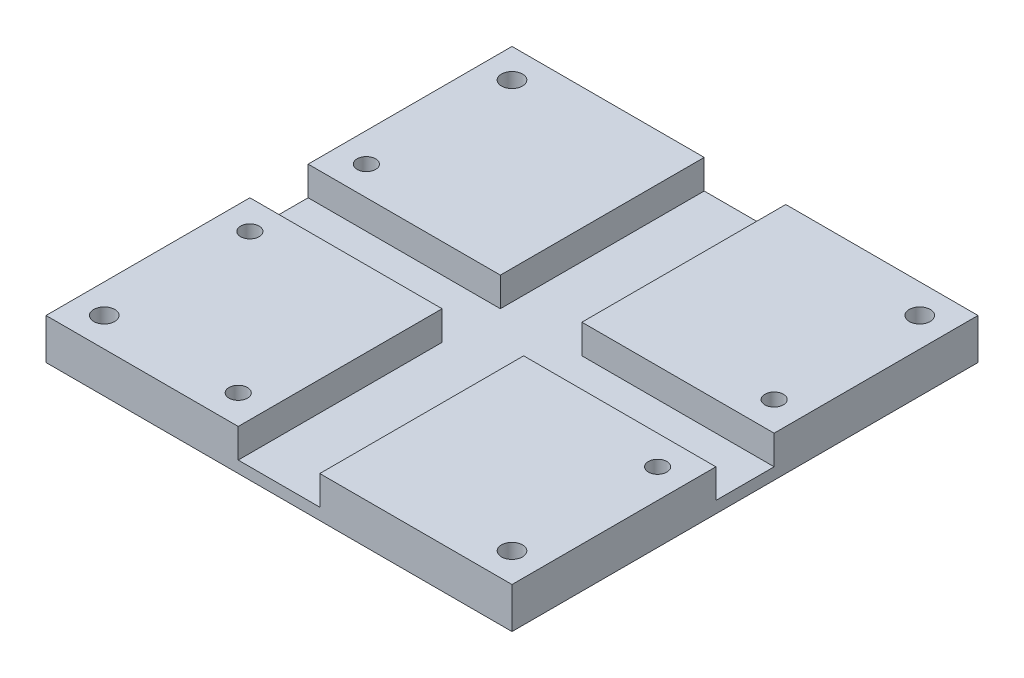
ISO-10303-21;
HEADER;
FILE_DESCRIPTION(('STEP AP214'),'2;1');
FILE_NAME('part.step','',(''),(''),'','','');
FILE_SCHEMA(('AUTOMOTIVE_DESIGN { 1 0 10303 214 1 1 1 1 }'));
ENDSEC;
DATA;
#1=APPLICATION_CONTEXT('core data for automotive mechanical design processes');
#2=APPLICATION_PROTOCOL_DEFINITION('international standard','automotive_design',2000,#1);
#3=PRODUCT_CONTEXT('',#1,'mechanical');
#4=PRODUCT('Part','Part','',(#3));
#5=PRODUCT_RELATED_PRODUCT_CATEGORY('part','',(#4));
#6=PRODUCT_DEFINITION_FORMATION('','',#4);
#7=PRODUCT_DEFINITION_CONTEXT('part definition',#1,'design');
#8=PRODUCT_DEFINITION('design','',#6,#7);
#9=PRODUCT_DEFINITION_SHAPE('','',#8);
#10=(LENGTH_UNIT() NAMED_UNIT(*) SI_UNIT(.MILLI.,.METRE.));
#11=(NAMED_UNIT(*) PLANE_ANGLE_UNIT() SI_UNIT($,.RADIAN.));
#12=(NAMED_UNIT(*) SI_UNIT($,.STERADIAN.) SOLID_ANGLE_UNIT());
#13=UNCERTAINTY_MEASURE_WITH_UNIT(LENGTH_MEASURE(1.E-05),#10,'distance_accuracy_value','');
#14=(GEOMETRIC_REPRESENTATION_CONTEXT(3) GLOBAL_UNCERTAINTY_ASSIGNED_CONTEXT((#13)) GLOBAL_UNIT_ASSIGNED_CONTEXT((#10,
#11,#12)) REPRESENTATION_CONTEXT('',''));
#15=CARTESIAN_POINT('',(0.,0.,0.));
#16=DIRECTION('',(0.,0.,1.));
#17=DIRECTION('',(1.,0.,0.));
#18=AXIS2_PLACEMENT_3D('',#15,#16,#17);
#19=CARTESIAN_POINT('',(0.,2.,0.));
#20=DIRECTION('',(0.,-1.,0.));
#21=DIRECTION('',(0.,0.,-1.));
#22=AXIS2_PLACEMENT_3D('',#19,#20,#21);
#23=PLANE('',#22);
#24=DIRECTION('',(0.,0.,-1.));
#25=VECTOR('',#24,1.);
#26=CARTESIAN_POINT('',(33.,2.,-45.));
#27=LINE('',#26,#25);
#28=CARTESIAN_POINT('',(33.,2.,-45.));
#29=VERTEX_POINT('',#28);
#30=CARTESIAN_POINT('',(33.,2.,-80.));
#31=VERTEX_POINT('',#30);
#32=EDGE_CURVE('E50',#29,#31,#27,.T.);
#33=ORIENTED_EDGE('',*,*,#32,.F.);
#34=DIRECTION('',(1.,0.,0.));
#35=VECTOR('',#34,1.);
#36=CARTESIAN_POINT('',(33.,2.,-45.));
#37=LINE('',#36,#35);
#38=CARTESIAN_POINT('',(0.,2.,-45.));
#39=VERTEX_POINT('',#38);
#40=EDGE_CURVE('E54',#39,#29,#37,.T.);
#41=ORIENTED_EDGE('',*,*,#40,.F.);
#42=DIRECTION('',(0.,0.,1.));
#43=VECTOR('',#42,1.);
#44=CARTESIAN_POINT('',(0.,2.,0.));
#45=LINE('',#44,#43);
#46=CARTESIAN_POINT('',(0.,2.,-35.));
#47=VERTEX_POINT('',#46);
#48=EDGE_CURVE('E254',#39,#47,#45,.T.);
#49=ORIENTED_EDGE('',*,*,#48,.T.);
#50=DIRECTION('',(-1.,0.,0.));
#51=VECTOR('',#50,1.);
#52=CARTESIAN_POINT('',(33.,2.,-35.));
#53=LINE('',#52,#51);
#54=CARTESIAN_POINT('',(33.,2.,-35.));
#55=VERTEX_POINT('',#54);
#56=EDGE_CURVE('E171',#55,#47,#53,.T.);
#57=ORIENTED_EDGE('',*,*,#56,.F.);
#58=DIRECTION('',(0.,0.,-1.));
#59=VECTOR('',#58,1.);
#60=CARTESIAN_POINT('',(33.,2.,0.));
#61=LINE('',#60,#59);
#62=CARTESIAN_POINT('',(33.,2.,0.));
#63=VERTEX_POINT('',#62);
#64=EDGE_CURVE('E167',#63,#55,#61,.T.);
#65=ORIENTED_EDGE('',*,*,#64,.F.);
#66=DIRECTION('',(1.,0.,0.));
#67=VECTOR('',#66,1.);
#68=CARTESIAN_POINT('',(0.,2.,0.));
#69=LINE('',#68,#67);
#70=CARTESIAN_POINT('',(47.,2.,0.));
#71=VERTEX_POINT('',#70);
#72=EDGE_CURVE('E250',#63,#71,#69,.T.);
#73=ORIENTED_EDGE('',*,*,#72,.T.);
#74=DIRECTION('',(0.,0.,1.));
#75=VECTOR('',#74,1.);
#76=CARTESIAN_POINT('',(47.,2.,0.));
#77=LINE('',#76,#75);
#78=CARTESIAN_POINT('',(47.,2.,-35.));
#79=VERTEX_POINT('',#78);
#80=EDGE_CURVE('E228',#79,#71,#77,.T.);
#81=ORIENTED_EDGE('',*,*,#80,.F.);
#82=DIRECTION('',(-1.,0.,0.));
#83=VECTOR('',#82,1.);
#84=CARTESIAN_POINT('',(80.,2.,-35.));
#85=LINE('',#84,#83);
#86=CARTESIAN_POINT('',(80.,2.,-35.));
#87=VERTEX_POINT('',#86);
#88=EDGE_CURVE('E223',#87,#79,#85,.T.);
#89=ORIENTED_EDGE('',*,*,#88,.F.);
#90=DIRECTION('',(0.,0.,-1.));
#91=VECTOR('',#90,1.);
#92=CARTESIAN_POINT('',(80.,2.,0.));
#93=LINE('',#92,#91);
#94=CARTESIAN_POINT('',(80.,2.,-45.));
#95=VERTEX_POINT('',#94);
#96=EDGE_CURVE('E253',#87,#95,#93,.T.);
#97=ORIENTED_EDGE('',*,*,#96,.T.);
#98=DIRECTION('',(1.,0.,0.));
#99=VECTOR('',#98,1.);
#100=CARTESIAN_POINT('',(80.,2.,-45.));
#101=LINE('',#100,#99);
#102=CARTESIAN_POINT('',(47.,2.,-45.));
#103=VERTEX_POINT('',#102);
#104=EDGE_CURVE('E204',#103,#95,#101,.T.);
#105=ORIENTED_EDGE('',*,*,#104,.F.);
#106=DIRECTION('',(0.,0.,1.));
#107=VECTOR('',#106,1.);
#108=CARTESIAN_POINT('',(47.,2.,-45.));
#109=LINE('',#108,#107);
#110=CARTESIAN_POINT('',(47.,2.,-80.));
#111=VERTEX_POINT('',#110);
#112=EDGE_CURVE('E199',#111,#103,#109,.T.);
#113=ORIENTED_EDGE('',*,*,#112,.F.);
#114=DIRECTION('',(-1.,0.,0.));
#115=VECTOR('',#114,1.);
#116=CARTESIAN_POINT('',(0.,2.,-80.));
#117=LINE('',#116,#115);
#118=EDGE_CURVE('E261',#111,#31,#117,.T.);
#119=ORIENTED_EDGE('',*,*,#118,.T.);
#120=EDGE_LOOP('',(#33,#41,#49,#57,#65,#73,#81,#89,#97,#105,#113,#119));
#121=FACE_BOUND('',#120,.T.);
#122=ADVANCED_FACE('F33',(#121),#23,.F.);
#123=CARTESIAN_POINT('',(0.,2.,0.));
#124=DIRECTION('',(1.,0.,0.));
#125=DIRECTION('',(0.,0.,-1.));
#126=AXIS2_PLACEMENT_3D('',#123,#124,#125);
#127=PLANE('',#126);
#128=DIRECTION('',(0.,0.,1.));
#129=VECTOR('',#128,1.);
#130=CARTESIAN_POINT('',(0.,0.,0.));
#131=LINE('',#130,#129);
#132=CARTESIAN_POINT('',(0.,0.,-80.));
#133=VERTEX_POINT('',#132);
#134=CARTESIAN_POINT('',(0.,0.,0.));
#135=VERTEX_POINT('',#134);
#136=EDGE_CURVE('E271',#133,#135,#131,.T.);
#137=ORIENTED_EDGE('',*,*,#136,.T.);
#138=DIRECTION('',(0.,-1.,0.));
#139=VECTOR('',#138,1.);
#140=CARTESIAN_POINT('',(0.,2.,0.));
#141=LINE('',#140,#139);
#142=CARTESIAN_POINT('',(0.,7.,0.));
#143=VERTEX_POINT('',#142);
#144=EDGE_CURVE('E11',#143,#135,#141,.T.);
#145=ORIENTED_EDGE('',*,*,#144,.F.);
#146=DIRECTION('',(0.,0.,1.));
#147=VECTOR('',#146,1.);
#148=CARTESIAN_POINT('',(0.,7.,0.));
#149=LINE('',#148,#147);
#150=CARTESIAN_POINT('',(0.,7.,-35.));
#151=VERTEX_POINT('',#150);
#152=EDGE_CURVE('E183',#151,#143,#149,.T.);
#153=ORIENTED_EDGE('',*,*,#152,.F.);
#154=DIRECTION('',(0.,-1.,0.));
#155=VECTOR('',#154,1.);
#156=CARTESIAN_POINT('',(0.,7.,-35.));
#157=LINE('',#156,#155);
#158=EDGE_CURVE('E193',#151,#47,#157,.T.);
#159=ORIENTED_EDGE('',*,*,#158,.T.);
#160=ORIENTED_EDGE('',*,*,#48,.F.);
#161=DIRECTION('',(0.,-1.,0.));
#162=VECTOR('',#161,1.);
#163=CARTESIAN_POINT('',(0.,7.,-45.));
#164=LINE('',#163,#162);
#165=CARTESIAN_POINT('',(0.,7.,-45.));
#166=VERTEX_POINT('',#165);
#167=EDGE_CURVE('E168',#166,#39,#164,.T.);
#168=ORIENTED_EDGE('',*,*,#167,.F.);
#169=DIRECTION('',(0.,0.,1.));
#170=VECTOR('',#169,1.);
#171=CARTESIAN_POINT('',(0.,7.,-45.));
#172=LINE('',#171,#170);
#173=CARTESIAN_POINT('',(0.,7.,-80.));
#174=VERTEX_POINT('',#173);
#175=EDGE_CURVE('E155',#174,#166,#172,.T.);
#176=ORIENTED_EDGE('',*,*,#175,.F.);
#177=DIRECTION('',(0.,-1.,0.));
#178=VECTOR('',#177,1.);
#179=CARTESIAN_POINT('',(0.,2.,-80.));
#180=LINE('',#179,#178);
#181=EDGE_CURVE('E152',#174,#133,#180,.T.);
#182=ORIENTED_EDGE('',*,*,#181,.T.);
#183=EDGE_LOOP('',(#137,#145,#153,#159,#160,#168,#176,#182));
#184=FACE_BOUND('',#183,.T.);
#185=ADVANCED_FACE('F35',(#184),#127,.F.);
#186=CARTESIAN_POINT('',(0.,2.,0.));
#187=DIRECTION('',(0.,0.,-1.));
#188=DIRECTION('',(-1.,0.,0.));
#189=AXIS2_PLACEMENT_3D('',#186,#187,#188);
#190=PLANE('',#189);
#191=DIRECTION('',(1.,0.,0.));
#192=VECTOR('',#191,1.);
#193=CARTESIAN_POINT('',(0.,0.,0.));
#194=LINE('',#193,#192);
#195=CARTESIAN_POINT('',(80.,0.,0.));
#196=VERTEX_POINT('',#195);
#197=EDGE_CURVE('E275',#135,#196,#194,.T.);
#198=ORIENTED_EDGE('',*,*,#197,.T.);
#199=DIRECTION('',(0.,-1.,0.));
#200=VECTOR('',#199,1.);
#201=CARTESIAN_POINT('',(80.,2.,0.));
#202=LINE('',#201,#200);
#203=CARTESIAN_POINT('',(80.,7.,0.));
#204=VERTEX_POINT('',#203);
#205=EDGE_CURVE('E42',#204,#196,#202,.T.);
#206=ORIENTED_EDGE('',*,*,#205,.F.);
#207=DIRECTION('',(1.,0.,0.));
#208=VECTOR('',#207,1.);
#209=CARTESIAN_POINT('',(80.,7.,0.));
#210=LINE('',#209,#208);
#211=CARTESIAN_POINT('',(47.,7.,0.));
#212=VERTEX_POINT('',#211);
#213=EDGE_CURVE('E232',#212,#204,#210,.T.);
#214=ORIENTED_EDGE('',*,*,#213,.F.);
#215=DIRECTION('',(0.,-1.,0.));
#216=VECTOR('',#215,1.);
#217=CARTESIAN_POINT('',(47.,7.,0.));
#218=LINE('',#217,#216);
#219=EDGE_CURVE('E235',#212,#71,#218,.T.);
#220=ORIENTED_EDGE('',*,*,#219,.T.);
#221=ORIENTED_EDGE('',*,*,#72,.F.);
#222=DIRECTION('',(0.,-1.,0.));
#223=VECTOR('',#222,1.);
#224=CARTESIAN_POINT('',(33.,7.,0.));
#225=LINE('',#224,#223);
#226=CARTESIAN_POINT('',(33.,7.,0.));
#227=VERTEX_POINT('',#226);
#228=EDGE_CURVE('E187',#227,#63,#225,.T.);
#229=ORIENTED_EDGE('',*,*,#228,.F.);
#230=DIRECTION('',(1.,0.,0.));
#231=VECTOR('',#230,1.);
#232=CARTESIAN_POINT('',(33.,7.,0.));
#233=LINE('',#232,#231);
#234=EDGE_CURVE('E186',#143,#227,#233,.T.);
#235=ORIENTED_EDGE('',*,*,#234,.F.);
#236=ORIENTED_EDGE('',*,*,#144,.T.);
#237=EDGE_LOOP('',(#198,#206,#214,#220,#221,#229,#235,#236));
#238=FACE_BOUND('',#237,.T.);
#239=ADVANCED_FACE('F317',(#238),#190,.F.);
#240=CARTESIAN_POINT('',(80.,2.,0.));
#241=DIRECTION('',(-1.,0.,0.));
#242=DIRECTION('',(0.,0.,1.));
#243=AXIS2_PLACEMENT_3D('',#240,#241,#242);
#244=PLANE('',#243);
#245=DIRECTION('',(0.,0.,-1.));
#246=VECTOR('',#245,1.);
#247=CARTESIAN_POINT('',(80.,0.,0.));
#248=LINE('',#247,#246);
#249=CARTESIAN_POINT('',(80.,0.,-80.));
#250=VERTEX_POINT('',#249);
#251=EDGE_CURVE('E310',#196,#250,#248,.T.);
#252=ORIENTED_EDGE('',*,*,#251,.T.);
#253=DIRECTION('',(0.,-1.,0.));
#254=VECTOR('',#253,1.);
#255=CARTESIAN_POINT('',(80.,2.,-80.));
#256=LINE('',#255,#254);
#257=CARTESIAN_POINT('',(80.,7.,-80.));
#258=VERTEX_POINT('',#257);
#259=EDGE_CURVE('E300',#258,#250,#256,.T.);
#260=ORIENTED_EDGE('',*,*,#259,.F.);
#261=DIRECTION('',(0.,0.,-1.));
#262=VECTOR('',#261,1.);
#263=CARTESIAN_POINT('',(80.,7.,-45.));
#264=LINE('',#263,#262);
#265=CARTESIAN_POINT('',(80.,7.,-45.));
#266=VERTEX_POINT('',#265);
#267=EDGE_CURVE('E200',#266,#258,#264,.T.);
#268=ORIENTED_EDGE('',*,*,#267,.F.);
#269=DIRECTION('',(0.,-1.,0.));
#270=VECTOR('',#269,1.);
#271=CARTESIAN_POINT('',(80.,7.,-45.));
#272=LINE('',#271,#270);
#273=EDGE_CURVE('E210',#266,#95,#272,.T.);
#274=ORIENTED_EDGE('',*,*,#273,.T.);
#275=ORIENTED_EDGE('',*,*,#96,.F.);
#276=DIRECTION('',(0.,-1.,0.));
#277=VECTOR('',#276,1.);
#278=CARTESIAN_POINT('',(80.,7.,-35.));
#279=LINE('',#278,#277);
#280=CARTESIAN_POINT('',(80.,7.,-35.));
#281=VERTEX_POINT('',#280);
#282=EDGE_CURVE('E269',#281,#87,#279,.T.);
#283=ORIENTED_EDGE('',*,*,#282,.F.);
#284=DIRECTION('',(0.,0.,-1.));
#285=VECTOR('',#284,1.);
#286=CARTESIAN_POINT('',(80.,7.,0.));
#287=LINE('',#286,#285);
#288=EDGE_CURVE('E224',#204,#281,#287,.T.);
#289=ORIENTED_EDGE('',*,*,#288,.F.);
#290=ORIENTED_EDGE('',*,*,#205,.T.);
#291=EDGE_LOOP('',(#252,#260,#268,#274,#275,#283,#289,#290));
#292=FACE_BOUND('',#291,.T.);
#293=ADVANCED_FACE('F285',(#292),#244,.F.);
#294=CARTESIAN_POINT('',(0.,2.,-80.));
#295=DIRECTION('',(0.,0.,1.));
#296=DIRECTION('',(1.,0.,0.));
#297=AXIS2_PLACEMENT_3D('',#294,#295,#296);
#298=PLANE('',#297);
#299=DIRECTION('',(-1.,0.,0.));
#300=VECTOR('',#299,1.);
#301=CARTESIAN_POINT('',(0.,0.,-80.));
#302=LINE('',#301,#300);
#303=EDGE_CURVE('E306',#250,#133,#302,.T.);
#304=ORIENTED_EDGE('',*,*,#303,.T.);
#305=ORIENTED_EDGE('',*,*,#181,.F.);
#306=DIRECTION('',(-1.,0.,0.));
#307=VECTOR('',#306,1.);
#308=CARTESIAN_POINT('',(33.,7.,-80.));
#309=LINE('',#308,#307);
#310=CARTESIAN_POINT('',(33.,7.,-80.));
#311=VERTEX_POINT('',#310);
#312=EDGE_CURVE('E146',#311,#174,#309,.T.);
#313=ORIENTED_EDGE('',*,*,#312,.F.);
#314=DIRECTION('',(0.,-1.,0.));
#315=VECTOR('',#314,1.);
#316=CARTESIAN_POINT('',(33.,7.,-80.));
#317=LINE('',#316,#315);
#318=EDGE_CURVE('E150',#311,#31,#317,.T.);
#319=ORIENTED_EDGE('',*,*,#318,.T.);
#320=ORIENTED_EDGE('',*,*,#118,.F.);
#321=DIRECTION('',(0.,-1.,0.));
#322=VECTOR('',#321,1.);
#323=CARTESIAN_POINT('',(47.,7.,-80.));
#324=LINE('',#323,#322);
#325=CARTESIAN_POINT('',(47.,7.,-80.));
#326=VERTEX_POINT('',#325);
#327=EDGE_CURVE('E220',#326,#111,#324,.T.);
#328=ORIENTED_EDGE('',*,*,#327,.F.);
#329=DIRECTION('',(-1.,0.,0.));
#330=VECTOR('',#329,1.);
#331=CARTESIAN_POINT('',(80.,7.,-80.));
#332=LINE('',#331,#330);
#333=EDGE_CURVE('E203',#258,#326,#332,.T.);
#334=ORIENTED_EDGE('',*,*,#333,.F.);
#335=ORIENTED_EDGE('',*,*,#259,.T.);
#336=EDGE_LOOP('',(#304,#305,#313,#319,#320,#328,#334,#335));
#337=FACE_BOUND('',#336,.T.);
#338=ADVANCED_FACE('F148',(#337),#298,.F.);
#339=CARTESIAN_POINT('',(0.,0.,0.));
#340=DIRECTION('',(0.,-1.,0.));
#341=DIRECTION('',(0.,0.,-1.));
#342=AXIS2_PLACEMENT_3D('',#339,#340,#341);
#343=PLANE('',#342);
#344=CARTESIAN_POINT('',(28.,0.,-5.));
#345=DIRECTION('',(0.,1.,0.));
#346=DIRECTION('',(0.,0.,1.));
#347=AXIS2_PLACEMENT_3D('',#344,#345,#346);
#348=CIRCLE('',#347,1.5875);
#349=CARTESIAN_POINT('',(28.,0.,-3.4125));
#350=VERTEX_POINT('',#349);
#351=EDGE_CURVE('E588',#350,#350,#348,.T.);
#352=ORIENTED_EDGE('',*,*,#351,.T.);
#353=EDGE_LOOP('',(#352));
#354=FACE_BOUND('',#353,.T.);
#355=CARTESIAN_POINT('',(75.,0.,-50.));
#356=DIRECTION('',(0.,1.,0.));
#357=DIRECTION('',(0.,0.,1.));
#358=AXIS2_PLACEMENT_3D('',#355,#356,#357);
#359=CIRCLE('',#358,1.5875);
#360=CARTESIAN_POINT('',(75.,0.,-48.4125));
#361=VERTEX_POINT('',#360);
#362=EDGE_CURVE('E596',#361,#361,#359,.T.);
#363=ORIENTED_EDGE('',*,*,#362,.T.);
#364=EDGE_LOOP('',(#363));
#365=FACE_BOUND('',#364,.T.);
#366=CARTESIAN_POINT('',(75.,0.,-30.));
#367=DIRECTION('',(0.,1.,0.));
#368=DIRECTION('',(0.,0.,1.));
#369=AXIS2_PLACEMENT_3D('',#366,#367,#368);
#370=CIRCLE('',#369,1.5875);
#371=CARTESIAN_POINT('',(75.,0.,-28.4125));
#372=VERTEX_POINT('',#371);
#373=EDGE_CURVE('E602',#372,#372,#370,.T.);
#374=ORIENTED_EDGE('',*,*,#373,.T.);
#375=EDGE_LOOP('',(#374));
#376=FACE_BOUND('',#375,.T.);
#377=CARTESIAN_POINT('',(5.,0.,-50.));
#378=DIRECTION('',(0.,1.,0.));
#379=DIRECTION('',(0.,0.,1.));
#380=AXIS2_PLACEMENT_3D('',#377,#378,#379);
#381=CIRCLE('',#380,1.5875);
#382=CARTESIAN_POINT('',(5.,0.,-48.4125));
#383=VERTEX_POINT('',#382);
#384=EDGE_CURVE('E608',#383,#383,#381,.T.);
#385=ORIENTED_EDGE('',*,*,#384,.T.);
#386=EDGE_LOOP('',(#385));
#387=FACE_BOUND('',#386,.T.);
#388=CARTESIAN_POINT('',(5.,0.,-30.));
#389=DIRECTION('',(0.,1.,0.));
#390=DIRECTION('',(0.,0.,1.));
#391=AXIS2_PLACEMENT_3D('',#388,#389,#390);
#392=CIRCLE('',#391,1.5875);
#393=CARTESIAN_POINT('',(5.,0.,-28.4125));
#394=VERTEX_POINT('',#393);
#395=EDGE_CURVE('E614',#394,#394,#392,.T.);
#396=ORIENTED_EDGE('',*,*,#395,.T.);
#397=EDGE_LOOP('',(#396));
#398=FACE_BOUND('',#397,.T.);
#399=CARTESIAN_POINT('',(5.,0.,-5.));
#400=DIRECTION('',(0.,1.,0.));
#401=DIRECTION('',(0.,0.,1.));
#402=AXIS2_PLACEMENT_3D('',#399,#400,#401);
#403=CIRCLE('',#402,1.8);
#404=CARTESIAN_POINT('',(5.,0.,-3.2));
#405=VERTEX_POINT('',#404);
#406=EDGE_CURVE('E617',#405,#405,#403,.T.);
#407=ORIENTED_EDGE('',*,*,#406,.T.);
#408=EDGE_LOOP('',(#407));
#409=FACE_BOUND('',#408,.T.);
#410=CARTESIAN_POINT('',(75.,0.,-5.));
#411=DIRECTION('',(0.,1.,0.));
#412=DIRECTION('',(0.,0.,1.));
#413=AXIS2_PLACEMENT_3D('',#410,#411,#412);
#414=CIRCLE('',#413,1.79999999999999);
#415=CARTESIAN_POINT('',(75.,0.,-3.20000000000001));
#416=VERTEX_POINT('',#415);
#417=EDGE_CURVE('E622',#416,#416,#414,.T.);
#418=ORIENTED_EDGE('',*,*,#417,.T.);
#419=EDGE_LOOP('',(#418));
#420=FACE_BOUND('',#419,.T.);
#421=CARTESIAN_POINT('',(75.,0.,-75.));
#422=DIRECTION('',(0.,1.,0.));
#423=DIRECTION('',(0.,0.,1.));
#424=AXIS2_PLACEMENT_3D('',#421,#422,#423);
#425=CIRCLE('',#424,1.79999999999999);
#426=CARTESIAN_POINT('',(75.,0.,-73.2));
#427=VERTEX_POINT('',#426);
#428=EDGE_CURVE('E626',#427,#427,#425,.T.);
#429=ORIENTED_EDGE('',*,*,#428,.T.);
#430=EDGE_LOOP('',(#429));
#431=FACE_BOUND('',#430,.T.);
#432=CARTESIAN_POINT('',(5.,0.,-75.));
#433=DIRECTION('',(0.,1.,0.));
#434=DIRECTION('',(0.,0.,1.));
#435=AXIS2_PLACEMENT_3D('',#432,#433,#434);
#436=CIRCLE('',#435,1.8);
#437=CARTESIAN_POINT('',(5.,0.,-73.2));
#438=VERTEX_POINT('',#437);
#439=EDGE_CURVE('E630',#438,#438,#436,.T.);
#440=ORIENTED_EDGE('',*,*,#439,.T.);
#441=EDGE_LOOP('',(#440));
#442=FACE_BOUND('',#441,.T.);
#443=ORIENTED_EDGE('',*,*,#136,.F.);
#444=ORIENTED_EDGE('',*,*,#303,.F.);
#445=ORIENTED_EDGE('',*,*,#251,.F.);
#446=ORIENTED_EDGE('',*,*,#197,.F.);
#447=EDGE_LOOP('',(#443,#444,#445,#446));
#448=FACE_BOUND('',#447,.T.);
#449=ADVANCED_FACE('F315',(#354,#365,#376,#387,#398,#409,#420,#431,#442,#448),#343,.T.);
#450=CARTESIAN_POINT('',(80.,7.,-35.));
#451=DIRECTION('',(0.,0.,1.));
#452=DIRECTION('',(1.,0.,0.));
#453=AXIS2_PLACEMENT_3D('',#450,#451,#452);
#454=PLANE('',#453);
#455=ORIENTED_EDGE('',*,*,#88,.T.);
#456=DIRECTION('',(0.,-1.,0.));
#457=VECTOR('',#456,1.);
#458=CARTESIAN_POINT('',(47.,7.,-35.));
#459=LINE('',#458,#457);
#460=CARTESIAN_POINT('',(47.,7.,-35.));
#461=VERTEX_POINT('',#460);
#462=EDGE_CURVE('E238',#461,#79,#459,.T.);
#463=ORIENTED_EDGE('',*,*,#462,.F.);
#464=DIRECTION('',(-1.,0.,0.));
#465=VECTOR('',#464,1.);
#466=CARTESIAN_POINT('',(80.,7.,-35.));
#467=LINE('',#466,#465);
#468=EDGE_CURVE('E227',#281,#461,#467,.T.);
#469=ORIENTED_EDGE('',*,*,#468,.F.);
#470=ORIENTED_EDGE('',*,*,#282,.T.);
#471=EDGE_LOOP('',(#455,#463,#469,#470));
#472=FACE_BOUND('',#471,.T.);
#473=ADVANCED_FACE('F282',(#472),#454,.F.);
#474=CARTESIAN_POINT('',(47.,7.,0.));
#475=DIRECTION('',(1.,0.,0.));
#476=DIRECTION('',(0.,0.,-1.));
#477=AXIS2_PLACEMENT_3D('',#474,#475,#476);
#478=PLANE('',#477);
#479=ORIENTED_EDGE('',*,*,#80,.T.);
#480=ORIENTED_EDGE('',*,*,#219,.F.);
#481=DIRECTION('',(0.,0.,1.));
#482=VECTOR('',#481,1.);
#483=CARTESIAN_POINT('',(47.,7.,0.));
#484=LINE('',#483,#482);
#485=EDGE_CURVE('E230',#461,#212,#484,.T.);
#486=ORIENTED_EDGE('',*,*,#485,.F.);
#487=ORIENTED_EDGE('',*,*,#462,.T.);
#488=EDGE_LOOP('',(#479,#480,#486,#487));
#489=FACE_BOUND('',#488,.T.);
#490=ADVANCED_FACE('F280',(#489),#478,.F.);
#491=CARTESIAN_POINT('',(0.,7.,0.));
#492=DIRECTION('',(0.,1.,0.));
#493=DIRECTION('',(0.,0.,1.));
#494=AXIS2_PLACEMENT_3D('',#491,#492,#493);
#495=PLANE('',#494);
#496=CARTESIAN_POINT('',(75.,7.,-30.));
#497=DIRECTION('',(0.,1.,0.));
#498=DIRECTION('',(0.,0.,1.));
#499=AXIS2_PLACEMENT_3D('',#496,#497,#498);
#500=CIRCLE('',#499,1.5875);
#501=CARTESIAN_POINT('',(75.,7.,-28.4125));
#502=VERTEX_POINT('',#501);
#503=EDGE_CURVE('E599',#502,#502,#500,.T.);
#504=ORIENTED_EDGE('',*,*,#503,.F.);
#505=EDGE_LOOP('',(#504));
#506=FACE_BOUND('',#505,.T.);
#507=CARTESIAN_POINT('',(75.,7.,-5.));
#508=DIRECTION('',(0.,1.,0.));
#509=DIRECTION('',(0.,0.,1.));
#510=AXIS2_PLACEMENT_3D('',#507,#508,#509);
#511=CIRCLE('',#510,1.79999999999999);
#512=CARTESIAN_POINT('',(75.,7.,-3.20000000000001));
#513=VERTEX_POINT('',#512);
#514=EDGE_CURVE('E625',#513,#513,#511,.T.);
#515=ORIENTED_EDGE('',*,*,#514,.F.);
#516=EDGE_LOOP('',(#515));
#517=FACE_BOUND('',#516,.T.);
#518=ORIENTED_EDGE('',*,*,#288,.T.);
#519=ORIENTED_EDGE('',*,*,#468,.T.);
#520=ORIENTED_EDGE('',*,*,#485,.T.);
#521=ORIENTED_EDGE('',*,*,#213,.T.);
#522=EDGE_LOOP('',(#518,#519,#520,#521));
#523=FACE_BOUND('',#522,.T.);
#524=ADVANCED_FACE('F364',(#506,#517,#523),#495,.T.);
#525=CARTESIAN_POINT('',(47.,7.,-45.));
#526=DIRECTION('',(1.,0.,0.));
#527=DIRECTION('',(0.,0.,-1.));
#528=AXIS2_PLACEMENT_3D('',#525,#526,#527);
#529=PLANE('',#528);
#530=ORIENTED_EDGE('',*,*,#112,.T.);
#531=DIRECTION('',(0.,-1.,0.));
#532=VECTOR('',#531,1.);
#533=CARTESIAN_POINT('',(47.,7.,-45.));
#534=LINE('',#533,#532);
#535=CARTESIAN_POINT('',(47.,7.,-45.));
#536=VERTEX_POINT('',#535);
#537=EDGE_CURVE('E217',#536,#103,#534,.T.);
#538=ORIENTED_EDGE('',*,*,#537,.F.);
#539=DIRECTION('',(0.,0.,1.));
#540=VECTOR('',#539,1.);
#541=CARTESIAN_POINT('',(47.,7.,-45.));
#542=LINE('',#541,#540);
#543=EDGE_CURVE('E206',#326,#536,#542,.T.);
#544=ORIENTED_EDGE('',*,*,#543,.F.);
#545=ORIENTED_EDGE('',*,*,#327,.T.);
#546=EDGE_LOOP('',(#530,#538,#544,#545));
#547=FACE_BOUND('',#546,.T.);
#548=ADVANCED_FACE('F295',(#547),#529,.F.);
#549=CARTESIAN_POINT('',(80.,7.,-45.));
#550=DIRECTION('',(0.,0.,-1.));
#551=DIRECTION('',(-1.,0.,0.));
#552=AXIS2_PLACEMENT_3D('',#549,#550,#551);
#553=PLANE('',#552);
#554=ORIENTED_EDGE('',*,*,#104,.T.);
#555=ORIENTED_EDGE('',*,*,#273,.F.);
#556=DIRECTION('',(1.,0.,0.));
#557=VECTOR('',#556,1.);
#558=CARTESIAN_POINT('',(80.,7.,-45.));
#559=LINE('',#558,#557);
#560=EDGE_CURVE('E208',#536,#266,#559,.T.);
#561=ORIENTED_EDGE('',*,*,#560,.F.);
#562=ORIENTED_EDGE('',*,*,#537,.T.);
#563=EDGE_LOOP('',(#554,#555,#561,#562));
#564=FACE_BOUND('',#563,.T.);
#565=ADVANCED_FACE('F291',(#564),#553,.F.);
#566=CARTESIAN_POINT('',(0.,7.,-45.));
#567=DIRECTION('',(0.,1.,0.));
#568=DIRECTION('',(0.,0.,1.));
#569=AXIS2_PLACEMENT_3D('',#566,#567,#568);
#570=PLANE('',#569);
#571=CARTESIAN_POINT('',(75.,7.,-50.));
#572=DIRECTION('',(0.,1.,0.));
#573=DIRECTION('',(0.,0.,1.));
#574=AXIS2_PLACEMENT_3D('',#571,#572,#573);
#575=CIRCLE('',#574,1.5875);
#576=CARTESIAN_POINT('',(75.,7.,-48.4125));
#577=VERTEX_POINT('',#576);
#578=EDGE_CURVE('E593',#577,#577,#575,.T.);
#579=ORIENTED_EDGE('',*,*,#578,.F.);
#580=EDGE_LOOP('',(#579));
#581=FACE_BOUND('',#580,.T.);
#582=CARTESIAN_POINT('',(75.,7.,-75.));
#583=DIRECTION('',(0.,1.,0.));
#584=DIRECTION('',(0.,0.,1.));
#585=AXIS2_PLACEMENT_3D('',#582,#583,#584);
#586=CIRCLE('',#585,1.79999999999999);
#587=CARTESIAN_POINT('',(75.,7.,-73.2));
#588=VERTEX_POINT('',#587);
#589=EDGE_CURVE('E629',#588,#588,#586,.T.);
#590=ORIENTED_EDGE('',*,*,#589,.F.);
#591=EDGE_LOOP('',(#590));
#592=FACE_BOUND('',#591,.T.);
#593=ORIENTED_EDGE('',*,*,#267,.T.);
#594=ORIENTED_EDGE('',*,*,#333,.T.);
#595=ORIENTED_EDGE('',*,*,#543,.T.);
#596=ORIENTED_EDGE('',*,*,#560,.T.);
#597=EDGE_LOOP('',(#593,#594,#595,#596));
#598=FACE_BOUND('',#597,.T.);
#599=ADVANCED_FACE('F384',(#581,#592,#598),#570,.T.);
#600=CARTESIAN_POINT('',(33.,7.,0.));
#601=DIRECTION('',(-1.,0.,0.));
#602=DIRECTION('',(0.,0.,1.));
#603=AXIS2_PLACEMENT_3D('',#600,#601,#602);
#604=PLANE('',#603);
#605=ORIENTED_EDGE('',*,*,#64,.T.);
#606=DIRECTION('',(0.,-1.,0.));
#607=VECTOR('',#606,1.);
#608=CARTESIAN_POINT('',(33.,7.,-35.));
#609=LINE('',#608,#607);
#610=CARTESIAN_POINT('',(33.,7.,-35.));
#611=VERTEX_POINT('',#610);
#612=EDGE_CURVE('E196',#611,#55,#609,.T.);
#613=ORIENTED_EDGE('',*,*,#612,.F.);
#614=DIRECTION('',(0.,0.,-1.));
#615=VECTOR('',#614,1.);
#616=CARTESIAN_POINT('',(33.,7.,0.));
#617=LINE('',#616,#615);
#618=EDGE_CURVE('E178',#227,#611,#617,.T.);
#619=ORIENTED_EDGE('',*,*,#618,.F.);
#620=ORIENTED_EDGE('',*,*,#228,.T.);
#621=EDGE_LOOP('',(#605,#613,#619,#620));
#622=FACE_BOUND('',#621,.T.);
#623=ADVANCED_FACE('F391',(#622),#604,.F.);
#624=CARTESIAN_POINT('',(33.,7.,-35.));
#625=DIRECTION('',(0.,0.,1.));
#626=DIRECTION('',(1.,0.,0.));
#627=AXIS2_PLACEMENT_3D('',#624,#625,#626);
#628=PLANE('',#627);
#629=ORIENTED_EDGE('',*,*,#56,.T.);
#630=ORIENTED_EDGE('',*,*,#158,.F.);
#631=DIRECTION('',(-1.,0.,0.));
#632=VECTOR('',#631,1.);
#633=CARTESIAN_POINT('',(33.,7.,-35.));
#634=LINE('',#633,#632);
#635=EDGE_CURVE('E181',#611,#151,#634,.T.);
#636=ORIENTED_EDGE('',*,*,#635,.F.);
#637=ORIENTED_EDGE('',*,*,#612,.T.);
#638=EDGE_LOOP('',(#629,#630,#636,#637));
#639=FACE_BOUND('',#638,.T.);
#640=ADVANCED_FACE('F399',(#639),#628,.F.);
#641=CARTESIAN_POINT('',(-47.,7.,0.));
#642=DIRECTION('',(0.,1.,0.));
#643=DIRECTION('',(0.,0.,1.));
#644=AXIS2_PLACEMENT_3D('',#641,#642,#643);
#645=PLANE('',#644);
#646=CARTESIAN_POINT('',(28.,7.,-5.));
#647=DIRECTION('',(0.,1.,0.));
#648=DIRECTION('',(0.,0.,1.));
#649=AXIS2_PLACEMENT_3D('',#646,#647,#648);
#650=CIRCLE('',#649,1.5875);
#651=CARTESIAN_POINT('',(28.,7.,-3.4125));
#652=VERTEX_POINT('',#651);
#653=EDGE_CURVE('E591',#652,#652,#650,.T.);
#654=ORIENTED_EDGE('',*,*,#653,.F.);
#655=EDGE_LOOP('',(#654));
#656=FACE_BOUND('',#655,.T.);
#657=CARTESIAN_POINT('',(5.,7.,-30.));
#658=DIRECTION('',(0.,1.,0.));
#659=DIRECTION('',(0.,0.,1.));
#660=AXIS2_PLACEMENT_3D('',#657,#658,#659);
#661=CIRCLE('',#660,1.5875);
#662=CARTESIAN_POINT('',(5.,7.,-28.4125));
#663=VERTEX_POINT('',#662);
#664=EDGE_CURVE('E611',#663,#663,#661,.T.);
#665=ORIENTED_EDGE('',*,*,#664,.F.);
#666=EDGE_LOOP('',(#665));
#667=FACE_BOUND('',#666,.T.);
#668=CARTESIAN_POINT('',(5.,7.,-5.));
#669=DIRECTION('',(0.,1.,0.));
#670=DIRECTION('',(0.,0.,1.));
#671=AXIS2_PLACEMENT_3D('',#668,#669,#670);
#672=CIRCLE('',#671,1.8);
#673=CARTESIAN_POINT('',(5.,7.,-3.2));
#674=VERTEX_POINT('',#673);
#675=EDGE_CURVE('E37',#674,#674,#672,.T.);
#676=ORIENTED_EDGE('',*,*,#675,.F.);
#677=EDGE_LOOP('',(#676));
#678=FACE_BOUND('',#677,.T.);
#679=ORIENTED_EDGE('',*,*,#618,.T.);
#680=ORIENTED_EDGE('',*,*,#635,.T.);
#681=ORIENTED_EDGE('',*,*,#152,.T.);
#682=ORIENTED_EDGE('',*,*,#234,.T.);
#683=EDGE_LOOP('',(#679,#680,#681,#682));
#684=FACE_BOUND('',#683,.T.);
#685=ADVANCED_FACE('F407',(#656,#667,#678,#684),#645,.T.);
#686=CARTESIAN_POINT('',(33.,7.,-45.));
#687=DIRECTION('',(-1.,0.,0.));
#688=DIRECTION('',(0.,0.,1.));
#689=AXIS2_PLACEMENT_3D('',#686,#687,#688);
#690=PLANE('',#689);
#691=ORIENTED_EDGE('',*,*,#32,.T.);
#692=ORIENTED_EDGE('',*,*,#318,.F.);
#693=DIRECTION('',(0.,0.,-1.));
#694=VECTOR('',#693,1.);
#695=CARTESIAN_POINT('',(33.,7.,-45.));
#696=LINE('',#695,#694);
#697=CARTESIAN_POINT('',(33.,7.,-45.));
#698=VERTEX_POINT('',#697);
#699=EDGE_CURVE('E156',#698,#311,#696,.T.);
#700=ORIENTED_EDGE('',*,*,#699,.F.);
#701=DIRECTION('',(0.,-1.,0.));
#702=VECTOR('',#701,1.);
#703=CARTESIAN_POINT('',(33.,7.,-45.));
#704=LINE('',#703,#702);
#705=EDGE_CURVE('E174',#698,#29,#704,.T.);
#706=ORIENTED_EDGE('',*,*,#705,.T.);
#707=EDGE_LOOP('',(#691,#692,#700,#706));
#708=FACE_BOUND('',#707,.T.);
#709=ADVANCED_FACE('F166',(#708),#690,.F.);
#710=CARTESIAN_POINT('',(33.,7.,-45.));
#711=DIRECTION('',(0.,0.,-1.));
#712=DIRECTION('',(-1.,0.,0.));
#713=AXIS2_PLACEMENT_3D('',#710,#711,#712);
#714=PLANE('',#713);
#715=ORIENTED_EDGE('',*,*,#40,.T.);
#716=ORIENTED_EDGE('',*,*,#705,.F.);
#717=DIRECTION('',(1.,0.,0.));
#718=VECTOR('',#717,1.);
#719=CARTESIAN_POINT('',(33.,7.,-45.));
#720=LINE('',#719,#718);
#721=EDGE_CURVE('E161',#166,#698,#720,.T.);
#722=ORIENTED_EDGE('',*,*,#721,.F.);
#723=ORIENTED_EDGE('',*,*,#167,.T.);
#724=EDGE_LOOP('',(#715,#716,#722,#723));
#725=FACE_BOUND('',#724,.T.);
#726=ADVANCED_FACE('F422',(#725),#714,.F.);
#727=CARTESIAN_POINT('',(-47.,7.,-45.));
#728=DIRECTION('',(0.,1.,0.));
#729=DIRECTION('',(0.,0.,1.));
#730=AXIS2_PLACEMENT_3D('',#727,#728,#729);
#731=PLANE('',#730);
#732=CARTESIAN_POINT('',(5.,7.,-50.));
#733=DIRECTION('',(0.,1.,0.));
#734=DIRECTION('',(0.,0.,1.));
#735=AXIS2_PLACEMENT_3D('',#732,#733,#734);
#736=CIRCLE('',#735,1.5875);
#737=CARTESIAN_POINT('',(5.,7.,-48.4125));
#738=VERTEX_POINT('',#737);
#739=EDGE_CURVE('E605',#738,#738,#736,.T.);
#740=ORIENTED_EDGE('',*,*,#739,.F.);
#741=EDGE_LOOP('',(#740));
#742=FACE_BOUND('',#741,.T.);
#743=CARTESIAN_POINT('',(5.,7.,-75.));
#744=DIRECTION('',(0.,1.,0.));
#745=DIRECTION('',(0.,0.,1.));
#746=AXIS2_PLACEMENT_3D('',#743,#744,#745);
#747=CIRCLE('',#746,1.8);
#748=CARTESIAN_POINT('',(5.,7.,-73.2));
#749=VERTEX_POINT('',#748);
#750=EDGE_CURVE('E255',#749,#749,#747,.T.);
#751=ORIENTED_EDGE('',*,*,#750,.F.);
#752=EDGE_LOOP('',(#751));
#753=FACE_BOUND('',#752,.T.);
#754=ORIENTED_EDGE('',*,*,#699,.T.);
#755=ORIENTED_EDGE('',*,*,#312,.T.);
#756=ORIENTED_EDGE('',*,*,#175,.T.);
#757=ORIENTED_EDGE('',*,*,#721,.T.);
#758=EDGE_LOOP('',(#754,#755,#756,#757));
#759=FACE_BOUND('',#758,.T.);
#760=ADVANCED_FACE('F159',(#742,#753,#759),#731,.T.);
#761=CARTESIAN_POINT('',(5.,0.,-75.));
#762=DIRECTION('',(0.,1.,0.));
#763=DIRECTION('',(0.,0.,1.));
#764=AXIS2_PLACEMENT_3D('',#761,#762,#763);
#765=CYLINDRICAL_SURFACE('',#764,1.8);
#766=ORIENTED_EDGE('',*,*,#750,.T.);
#767=EDGE_LOOP('',(#766));
#768=FACE_BOUND('',#767,.T.);
#769=ORIENTED_EDGE('',*,*,#439,.F.);
#770=EDGE_LOOP('',(#769));
#771=FACE_BOUND('',#770,.T.);
#772=ADVANCED_FACE('F436',(#768,#771),#765,.F.);
#773=CARTESIAN_POINT('',(75.,0.,-75.));
#774=DIRECTION('',(0.,1.,0.));
#775=DIRECTION('',(0.,0.,1.));
#776=AXIS2_PLACEMENT_3D('',#773,#774,#775);
#777=CYLINDRICAL_SURFACE('',#776,1.79999999999999);
#778=ORIENTED_EDGE('',*,*,#589,.T.);
#779=EDGE_LOOP('',(#778));
#780=FACE_BOUND('',#779,.T.);
#781=ORIENTED_EDGE('',*,*,#428,.F.);
#782=EDGE_LOOP('',(#781));
#783=FACE_BOUND('',#782,.T.);
#784=ADVANCED_FACE('F444',(#780,#783),#777,.F.);
#785=CARTESIAN_POINT('',(75.,0.,-5.));
#786=DIRECTION('',(0.,1.,0.));
#787=DIRECTION('',(0.,0.,1.));
#788=AXIS2_PLACEMENT_3D('',#785,#786,#787);
#789=CYLINDRICAL_SURFACE('',#788,1.79999999999999);
#790=ORIENTED_EDGE('',*,*,#514,.T.);
#791=EDGE_LOOP('',(#790));
#792=FACE_BOUND('',#791,.T.);
#793=ORIENTED_EDGE('',*,*,#417,.F.);
#794=EDGE_LOOP('',(#793));
#795=FACE_BOUND('',#794,.T.);
#796=ADVANCED_FACE('F452',(#792,#795),#789,.F.);
#797=CARTESIAN_POINT('',(5.,0.,-5.));
#798=DIRECTION('',(0.,1.,0.));
#799=DIRECTION('',(0.,0.,1.));
#800=AXIS2_PLACEMENT_3D('',#797,#798,#799);
#801=CYLINDRICAL_SURFACE('',#800,1.8);
#802=ORIENTED_EDGE('',*,*,#675,.T.);
#803=EDGE_LOOP('',(#802));
#804=FACE_BOUND('',#803,.T.);
#805=ORIENTED_EDGE('',*,*,#406,.F.);
#806=EDGE_LOOP('',(#805));
#807=FACE_BOUND('',#806,.T.);
#808=ADVANCED_FACE('F460',(#804,#807),#801,.F.);
#809=CARTESIAN_POINT('',(5.,0.,-30.));
#810=DIRECTION('',(0.,1.,0.));
#811=DIRECTION('',(0.,0.,1.));
#812=AXIS2_PLACEMENT_3D('',#809,#810,#811);
#813=CYLINDRICAL_SURFACE('',#812,1.5875);
#814=ORIENTED_EDGE('',*,*,#395,.F.);
#815=EDGE_LOOP('',(#814));
#816=FACE_BOUND('',#815,.T.);
#817=ORIENTED_EDGE('',*,*,#664,.T.);
#818=EDGE_LOOP('',(#817));
#819=FACE_BOUND('',#818,.T.);
#820=ADVANCED_FACE('F468',(#816,#819),#813,.F.);
#821=CARTESIAN_POINT('',(5.,0.,-50.));
#822=DIRECTION('',(0.,1.,0.));
#823=DIRECTION('',(0.,0.,1.));
#824=AXIS2_PLACEMENT_3D('',#821,#822,#823);
#825=CYLINDRICAL_SURFACE('',#824,1.5875);
#826=ORIENTED_EDGE('',*,*,#384,.F.);
#827=EDGE_LOOP('',(#826));
#828=FACE_BOUND('',#827,.T.);
#829=ORIENTED_EDGE('',*,*,#739,.T.);
#830=EDGE_LOOP('',(#829));
#831=FACE_BOUND('',#830,.T.);
#832=ADVANCED_FACE('F475',(#828,#831),#825,.F.);
#833=CARTESIAN_POINT('',(75.,0.,-30.));
#834=DIRECTION('',(0.,1.,0.));
#835=DIRECTION('',(0.,0.,1.));
#836=AXIS2_PLACEMENT_3D('',#833,#834,#835);
#837=CYLINDRICAL_SURFACE('',#836,1.5875);
#838=ORIENTED_EDGE('',*,*,#373,.F.);
#839=EDGE_LOOP('',(#838));
#840=FACE_BOUND('',#839,.T.);
#841=ORIENTED_EDGE('',*,*,#503,.T.);
#842=EDGE_LOOP('',(#841));
#843=FACE_BOUND('',#842,.T.);
#844=ADVANCED_FACE('F482',(#840,#843),#837,.F.);
#845=CARTESIAN_POINT('',(75.,0.,-50.));
#846=DIRECTION('',(0.,1.,0.));
#847=DIRECTION('',(0.,0.,1.));
#848=AXIS2_PLACEMENT_3D('',#845,#846,#847);
#849=CYLINDRICAL_SURFACE('',#848,1.5875);
#850=ORIENTED_EDGE('',*,*,#362,.F.);
#851=EDGE_LOOP('',(#850));
#852=FACE_BOUND('',#851,.T.);
#853=ORIENTED_EDGE('',*,*,#578,.T.);
#854=EDGE_LOOP('',(#853));
#855=FACE_BOUND('',#854,.T.);
#856=ADVANCED_FACE('F490',(#852,#855),#849,.F.);
#857=CARTESIAN_POINT('',(28.,0.,-5.));
#858=DIRECTION('',(0.,1.,0.));
#859=DIRECTION('',(0.,0.,1.));
#860=AXIS2_PLACEMENT_3D('',#857,#858,#859);
#861=CYLINDRICAL_SURFACE('',#860,1.5875);
#862=ORIENTED_EDGE('',*,*,#351,.F.);
#863=EDGE_LOOP('',(#862));
#864=FACE_BOUND('',#863,.T.);
#865=ORIENTED_EDGE('',*,*,#653,.T.);
#866=EDGE_LOOP('',(#865));
#867=FACE_BOUND('',#866,.T.);
#868=ADVANCED_FACE('F497',(#864,#867),#861,.F.);
#869=CLOSED_SHELL('',(#122,#185,#239,#293,#338,#449,#473,#490,#524,#548,#565,#599,#623,#640,
#685,#709,#726,#760,#772,#784,#796,#808,#820,#832,#844,#856,#868));
#870=MANIFOLD_SOLID_BREP('B2',#869);
#871=ADVANCED_BREP_SHAPE_REPRESENTATION('',(#18,#870),#14);
#872=SHAPE_DEFINITION_REPRESENTATION(#9,#871);
ENDSEC;
END-ISO-10303-21;
